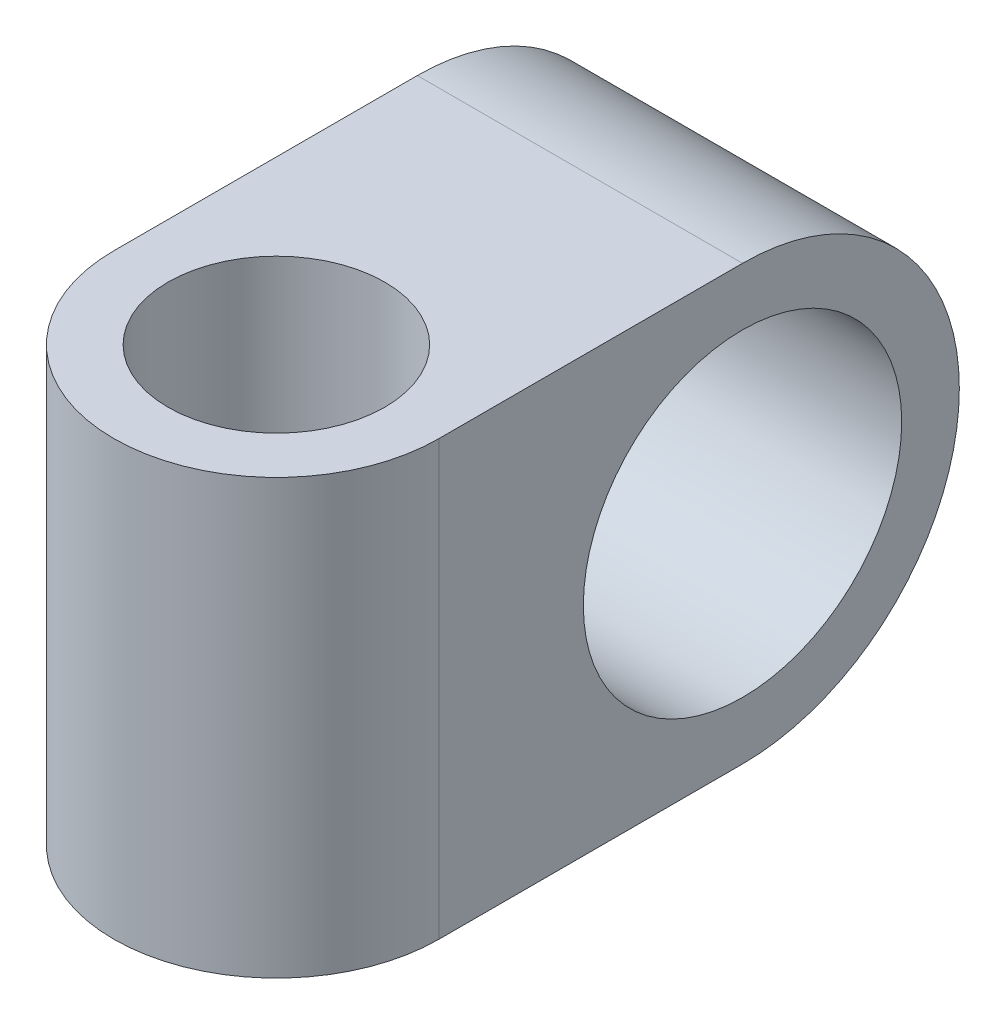
ISO-10303-21;
HEADER;
FILE_DESCRIPTION(('STEP AP214'),'2;1');
FILE_NAME('part.step','',(''),(''),'','','');
FILE_SCHEMA(('AUTOMOTIVE_DESIGN { 1 0 10303 214 1 1 1 1 }'));
ENDSEC;
DATA;
#1=APPLICATION_CONTEXT('core data for automotive mechanical design processes');
#2=APPLICATION_PROTOCOL_DEFINITION('international standard','automotive_design',2000,#1);
#3=PRODUCT_CONTEXT('',#1,'mechanical');
#4=PRODUCT('Part','Part','',(#3));
#5=PRODUCT_RELATED_PRODUCT_CATEGORY('part','',(#4));
#6=PRODUCT_DEFINITION_FORMATION('','',#4);
#7=PRODUCT_DEFINITION_CONTEXT('part definition',#1,'design');
#8=PRODUCT_DEFINITION('design','',#6,#7);
#9=PRODUCT_DEFINITION_SHAPE('','',#8);
#10=(LENGTH_UNIT() NAMED_UNIT(*) SI_UNIT(.MILLI.,.METRE.));
#11=(NAMED_UNIT(*) PLANE_ANGLE_UNIT() SI_UNIT($,.RADIAN.));
#12=(NAMED_UNIT(*) SI_UNIT($,.STERADIAN.) SOLID_ANGLE_UNIT());
#13=UNCERTAINTY_MEASURE_WITH_UNIT(LENGTH_MEASURE(1.E-05),#10,'distance_accuracy_value','');
#14=(GEOMETRIC_REPRESENTATION_CONTEXT(3) GLOBAL_UNCERTAINTY_ASSIGNED_CONTEXT((#13)) GLOBAL_UNIT_ASSIGNED_CONTEXT((#10,
#11,#12)) REPRESENTATION_CONTEXT('',''));
#15=CARTESIAN_POINT('',(0.,0.,0.));
#16=DIRECTION('',(0.,0.,1.));
#17=DIRECTION('',(1.,0.,0.));
#18=AXIS2_PLACEMENT_3D('',#15,#16,#17);
#19=CARTESIAN_POINT('',(-11.,0.,11.));
#20=DIRECTION('',(1.,0.,0.));
#21=DIRECTION('',(0.,0.,-1.));
#22=AXIS2_PLACEMENT_3D('',#19,#20,#21);
#23=CYLINDRICAL_SURFACE('',#22,10.);
#24=DIRECTION('',(1.,0.,0.));
#25=VECTOR('',#24,1.);
#26=CARTESIAN_POINT('',(-11.,10.,11.));
#27=LINE('',#26,#25);
#28=CARTESIAN_POINT('',(-7.5,10.,11.));
#29=VERTEX_POINT('',#28);
#30=CARTESIAN_POINT('',(7.5,10.,11.));
#31=VERTEX_POINT('',#30);
#32=EDGE_CURVE('E45',#29,#31,#27,.T.);
#33=ORIENTED_EDGE('',*,*,#32,.T.);
#34=CARTESIAN_POINT('',(7.5,0.,11.));
#35=DIRECTION('',(-1.,0.,0.));
#36=DIRECTION('',(0.,0.,1.));
#37=AXIS2_PLACEMENT_3D('',#34,#35,#36);
#38=CIRCLE('',#37,10.);
#39=CARTESIAN_POINT('',(7.5,-10.,11.));
#40=VERTEX_POINT('',#39);
#41=EDGE_CURVE('E106',#31,#40,#38,.T.);
#42=ORIENTED_EDGE('',*,*,#41,.T.);
#43=DIRECTION('',(1.,0.,0.));
#44=VECTOR('',#43,1.);
#45=CARTESIAN_POINT('',(-11.,-10.,11.));
#46=LINE('',#45,#44);
#47=CARTESIAN_POINT('',(-7.5,-10.,11.));
#48=VERTEX_POINT('',#47);
#49=EDGE_CURVE('E114',#48,#40,#46,.T.);
#50=ORIENTED_EDGE('',*,*,#49,.F.);
#51=CARTESIAN_POINT('',(-7.5,0.,11.));
#52=DIRECTION('',(1.,0.,0.));
#53=DIRECTION('',(0.,0.,-1.));
#54=AXIS2_PLACEMENT_3D('',#51,#52,#53);
#55=CIRCLE('',#54,10.);
#56=EDGE_CURVE('E52',#48,#29,#55,.T.);
#57=ORIENTED_EDGE('',*,*,#56,.T.);
#58=EDGE_LOOP('',(#33,#42,#50,#57));
#59=FACE_BOUND('',#58,.T.);
#60=ADVANCED_FACE('F38',(#59),#23,.T.);
#61=CARTESIAN_POINT('',(-11.,10.,11.));
#62=DIRECTION('',(0.,-1.,0.));
#63=DIRECTION('',(0.,0.,-1.));
#64=AXIS2_PLACEMENT_3D('',#61,#62,#63);
#65=PLANE('',#64);
#66=CARTESIAN_POINT('',(0.,10.,25.));
#67=DIRECTION('',(0.,1.,0.));
#68=DIRECTION('',(0.,0.,1.));
#69=AXIS2_PLACEMENT_3D('',#66,#67,#68);
#70=CIRCLE('',#69,5.);
#71=CARTESIAN_POINT('',(0.,10.,30.));
#72=VERTEX_POINT('',#71);
#73=EDGE_CURVE('E108',#72,#72,#70,.T.);
#74=ORIENTED_EDGE('',*,*,#73,.F.);
#75=EDGE_LOOP('',(#74));
#76=FACE_BOUND('',#75,.T.);
#77=CARTESIAN_POINT('',(0.,10.,25.));
#78=DIRECTION('',(0.,-1.,0.));
#79=DIRECTION('',(0.,0.,1.));
#80=AXIS2_PLACEMENT_3D('',#77,#78,#79);
#81=CIRCLE('',#80,7.5);
#82=CARTESIAN_POINT('',(7.5,10.,25.));
#83=VERTEX_POINT('',#82);
#84=CARTESIAN_POINT('',(-7.5,10.,25.));
#85=VERTEX_POINT('',#84);
#86=EDGE_CURVE('E87',#83,#85,#81,.T.);
#87=ORIENTED_EDGE('',*,*,#86,.F.);
#88=DIRECTION('',(0.,0.,1.));
#89=VECTOR('',#88,1.);
#90=CARTESIAN_POINT('',(7.5,10.,25.));
#91=LINE('',#90,#89);
#92=EDGE_CURVE('E96',#31,#83,#91,.T.);
#93=ORIENTED_EDGE('',*,*,#92,.F.);
#94=ORIENTED_EDGE('',*,*,#32,.F.);
#95=DIRECTION('',(0.,0.,-1.));
#96=VECTOR('',#95,1.);
#97=CARTESIAN_POINT('',(-7.5,10.,-6.84761832936738));
#98=LINE('',#97,#96);
#99=EDGE_CURVE('E78',#85,#29,#98,.T.);
#100=ORIENTED_EDGE('',*,*,#99,.F.);
#101=EDGE_LOOP('',(#87,#93,#94,#100));
#102=FACE_BOUND('',#101,.T.);
#103=ADVANCED_FACE('F94',(#76,#102),#65,.F.);
#104=CARTESIAN_POINT('',(-11.,-10.,11.));
#105=DIRECTION('',(0.,1.,0.));
#106=DIRECTION('',(0.,0.,1.));
#107=AXIS2_PLACEMENT_3D('',#104,#105,#106);
#108=PLANE('',#107);
#109=CARTESIAN_POINT('',(0.,-10.,25.));
#110=DIRECTION('',(0.,1.,0.));
#111=DIRECTION('',(0.,0.,1.));
#112=AXIS2_PLACEMENT_3D('',#109,#110,#111);
#113=CIRCLE('',#112,5.);
#114=CARTESIAN_POINT('',(0.,-10.,30.));
#115=VERTEX_POINT('',#114);
#116=EDGE_CURVE('E111',#115,#115,#113,.T.);
#117=ORIENTED_EDGE('',*,*,#116,.T.);
#118=EDGE_LOOP('',(#117));
#119=FACE_BOUND('',#118,.T.);
#120=ORIENTED_EDGE('',*,*,#49,.T.);
#121=DIRECTION('',(0.,0.,1.));
#122=VECTOR('',#121,1.);
#123=CARTESIAN_POINT('',(7.5,-10.,11.));
#124=LINE('',#123,#122);
#125=CARTESIAN_POINT('',(7.5,-10.,25.));
#126=VERTEX_POINT('',#125);
#127=EDGE_CURVE('E11',#40,#126,#124,.T.);
#128=ORIENTED_EDGE('',*,*,#127,.T.);
#129=CARTESIAN_POINT('',(0.,-10.,25.));
#130=DIRECTION('',(0.,-1.,0.));
#131=DIRECTION('',(0.,0.,1.));
#132=AXIS2_PLACEMENT_3D('',#129,#130,#131);
#133=CIRCLE('',#132,7.5);
#134=CARTESIAN_POINT('',(-7.5,-10.,25.));
#135=VERTEX_POINT('',#134);
#136=EDGE_CURVE('E98',#126,#135,#133,.T.);
#137=ORIENTED_EDGE('',*,*,#136,.T.);
#138=DIRECTION('',(0.,0.,-1.));
#139=VECTOR('',#138,1.);
#140=CARTESIAN_POINT('',(-7.5,-10.,-6.84761832936738));
#141=LINE('',#140,#139);
#142=EDGE_CURVE('E79',#135,#48,#141,.T.);
#143=ORIENTED_EDGE('',*,*,#142,.T.);
#144=EDGE_LOOP('',(#120,#128,#137,#143));
#145=FACE_BOUND('',#144,.T.);
#146=ADVANCED_FACE('F118',(#119,#145),#108,.F.);
#147=CARTESIAN_POINT('',(0.,-10.,25.));
#148=DIRECTION('',(0.,1.,0.));
#149=DIRECTION('',(0.,0.,1.));
#150=AXIS2_PLACEMENT_3D('',#147,#148,#149);
#151=CYLINDRICAL_SURFACE('',#150,5.);
#152=ORIENTED_EDGE('',*,*,#116,.F.);
#153=EDGE_LOOP('',(#152));
#154=FACE_BOUND('',#153,.T.);
#155=ORIENTED_EDGE('',*,*,#73,.T.);
#156=EDGE_LOOP('',(#155));
#157=FACE_BOUND('',#156,.T.);
#158=ADVANCED_FACE('F122',(#154,#157),#151,.F.);
#159=CARTESIAN_POINT('',(7.5,-10.,25.));
#160=DIRECTION('',(-1.,0.,0.));
#161=DIRECTION('',(0.,0.,1.));
#162=AXIS2_PLACEMENT_3D('',#159,#160,#161);
#163=PLANE('',#162);
#164=CARTESIAN_POINT('',(7.5,0.,11.));
#165=DIRECTION('',(1.,0.,0.));
#166=DIRECTION('',(0.,0.,-1.));
#167=AXIS2_PLACEMENT_3D('',#164,#165,#166);
#168=CIRCLE('',#167,7.34187);
#169=CARTESIAN_POINT('',(7.5,0.,3.65813));
#170=VERTEX_POINT('',#169);
#171=EDGE_CURVE('E159',#170,#170,#168,.T.);
#172=ORIENTED_EDGE('',*,*,#171,.F.);
#173=EDGE_LOOP('',(#172));
#174=FACE_BOUND('',#173,.T.);
#175=ORIENTED_EDGE('',*,*,#92,.T.);
#176=DIRECTION('',(0.,1.,0.));
#177=VECTOR('',#176,1.);
#178=CARTESIAN_POINT('',(7.5,-10.,25.));
#179=LINE('',#178,#177);
#180=EDGE_CURVE('E83',#126,#83,#179,.T.);
#181=ORIENTED_EDGE('',*,*,#180,.F.);
#182=ORIENTED_EDGE('',*,*,#127,.F.);
#183=ORIENTED_EDGE('',*,*,#41,.F.);
#184=EDGE_LOOP('',(#175,#181,#182,#183));
#185=FACE_BOUND('',#184,.T.);
#186=ADVANCED_FACE('F120',(#174,#185),#163,.F.);
#187=CARTESIAN_POINT('',(-7.5,-10.,-6.84761832936738));
#188=DIRECTION('',(1.,0.,0.));
#189=DIRECTION('',(0.,0.,-1.));
#190=AXIS2_PLACEMENT_3D('',#187,#188,#189);
#191=PLANE('',#190);
#192=CARTESIAN_POINT('',(-7.5,0.,11.));
#193=DIRECTION('',(1.,0.,0.));
#194=DIRECTION('',(0.,0.,-1.));
#195=AXIS2_PLACEMENT_3D('',#192,#193,#194);
#196=CIRCLE('',#195,7.34186999999999);
#197=CARTESIAN_POINT('',(-7.5,0.,3.65813));
#198=VERTEX_POINT('',#197);
#199=EDGE_CURVE('E91',#198,#198,#196,.T.);
#200=ORIENTED_EDGE('',*,*,#199,.T.);
#201=EDGE_LOOP('',(#200));
#202=FACE_BOUND('',#201,.T.);
#203=ORIENTED_EDGE('',*,*,#142,.F.);
#204=DIRECTION('',(0.,1.,0.));
#205=VECTOR('',#204,1.);
#206=CARTESIAN_POINT('',(-7.5,-10.,25.));
#207=LINE('',#206,#205);
#208=EDGE_CURVE('E74',#135,#85,#207,.T.);
#209=ORIENTED_EDGE('',*,*,#208,.T.);
#210=ORIENTED_EDGE('',*,*,#99,.T.);
#211=ORIENTED_EDGE('',*,*,#56,.F.);
#212=EDGE_LOOP('',(#203,#209,#210,#211));
#213=FACE_BOUND('',#212,.T.);
#214=ADVANCED_FACE('F76',(#202,#213),#191,.F.);
#215=CARTESIAN_POINT('',(0.,-10.,25.));
#216=DIRECTION('',(0.,1.,0.));
#217=DIRECTION('',(0.,0.,1.));
#218=AXIS2_PLACEMENT_3D('',#215,#216,#217);
#219=CYLINDRICAL_SURFACE('',#218,7.5);
#220=ORIENTED_EDGE('',*,*,#208,.F.);
#221=ORIENTED_EDGE('',*,*,#136,.F.);
#222=ORIENTED_EDGE('',*,*,#180,.T.);
#223=ORIENTED_EDGE('',*,*,#86,.T.);
#224=EDGE_LOOP('',(#220,#221,#222,#223));
#225=FACE_BOUND('',#224,.T.);
#226=ADVANCED_FACE('F88',(#225),#219,.T.);
#227=CARTESIAN_POINT('',(7.5,0.,11.));
#228=DIRECTION('',(1.,0.,0.));
#229=DIRECTION('',(0.,0.,-1.));
#230=AXIS2_PLACEMENT_3D('',#227,#228,#229);
#231=CYLINDRICAL_SURFACE('',#230,7.34187);
#232=ORIENTED_EDGE('',*,*,#199,.F.);
#233=EDGE_LOOP('',(#232));
#234=FACE_BOUND('',#233,.T.);
#235=ORIENTED_EDGE('',*,*,#171,.T.);
#236=EDGE_LOOP('',(#235));
#237=FACE_BOUND('',#236,.T.);
#238=ADVANCED_FACE('F148',(#234,#237),#231,.F.);
#239=CLOSED_SHELL('',(#60,#103,#146,#158,#186,#214,#226,#238));
#240=MANIFOLD_SOLID_BREP('B2',#239);
#241=ADVANCED_BREP_SHAPE_REPRESENTATION('',(#18,#240),#14);
#242=SHAPE_DEFINITION_REPRESENTATION(#9,#241);
ENDSEC;
END-ISO-10303-21;
